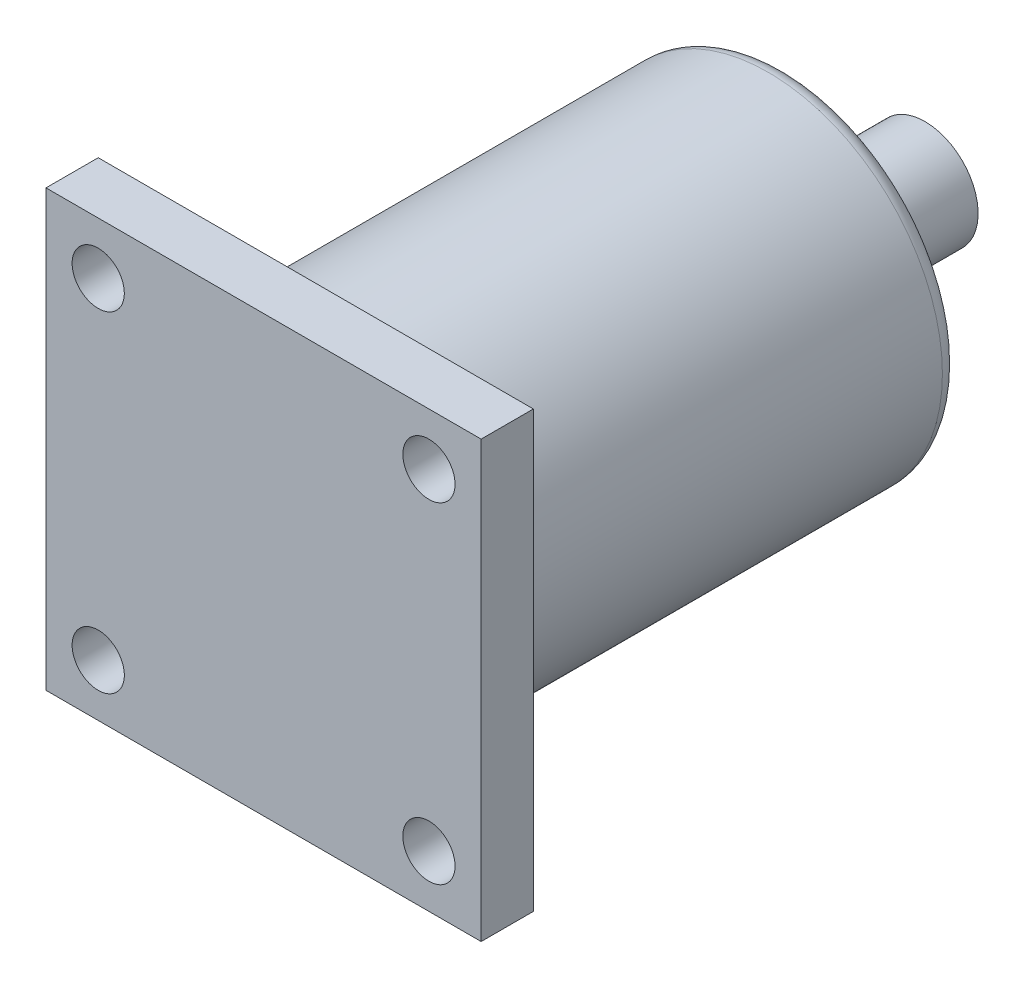
ISO-10303-21;
HEADER;
FILE_DESCRIPTION(('STEP AP214'),'2;1');
FILE_NAME('part.step','',(''),(''),'','','');
FILE_SCHEMA(('AUTOMOTIVE_DESIGN { 1 0 10303 214 1 1 1 1 }'));
ENDSEC;
DATA;
#1=APPLICATION_CONTEXT('core data for automotive mechanical design processes');
#2=APPLICATION_PROTOCOL_DEFINITION('international standard','automotive_design',2000,#1);
#3=PRODUCT_CONTEXT('',#1,'mechanical');
#4=PRODUCT('Part','Part','',(#3));
#5=PRODUCT_RELATED_PRODUCT_CATEGORY('part','',(#4));
#6=PRODUCT_DEFINITION_FORMATION('','',#4);
#7=PRODUCT_DEFINITION_CONTEXT('part definition',#1,'design');
#8=PRODUCT_DEFINITION('design','',#6,#7);
#9=PRODUCT_DEFINITION_SHAPE('','',#8);
#10=(LENGTH_UNIT() NAMED_UNIT(*) SI_UNIT(.MILLI.,.METRE.));
#11=(NAMED_UNIT(*) PLANE_ANGLE_UNIT() SI_UNIT($,.RADIAN.));
#12=(NAMED_UNIT(*) SI_UNIT($,.STERADIAN.) SOLID_ANGLE_UNIT());
#13=UNCERTAINTY_MEASURE_WITH_UNIT(LENGTH_MEASURE(1.E-05),#10,'distance_accuracy_value','');
#14=(GEOMETRIC_REPRESENTATION_CONTEXT(3) GLOBAL_UNCERTAINTY_ASSIGNED_CONTEXT((#13)) GLOBAL_UNIT_ASSIGNED_CONTEXT((#10,
#11,#12)) REPRESENTATION_CONTEXT('',''));
#15=CARTESIAN_POINT('',(0.,0.,0.));
#16=DIRECTION('',(0.,0.,1.));
#17=DIRECTION('',(1.,0.,0.));
#18=AXIS2_PLACEMENT_3D('',#15,#16,#17);
#19=CARTESIAN_POINT('',(0.,0.,3.));
#20=DIRECTION('',(1.,0.,0.));
#21=DIRECTION('',(0.,1.,0.));
#22=AXIS2_PLACEMENT_3D('',#19,#20,#21);
#23=PLANE('',#22);
#24=DIRECTION('',(0.,-1.,0.));
#25=VECTOR('',#24,1.);
#26=CARTESIAN_POINT('',(0.,0.,0.));
#27=LINE('',#26,#25);
#28=CARTESIAN_POINT('',(0.,0.,0.));
#29=VERTEX_POINT('',#28);
#30=CARTESIAN_POINT('',(0.,-25.,0.));
#31=VERTEX_POINT('',#30);
#32=EDGE_CURVE('E101',#29,#31,#27,.T.);
#33=ORIENTED_EDGE('',*,*,#32,.T.);
#34=DIRECTION('',(0.,0.,-1.));
#35=VECTOR('',#34,1.);
#36=CARTESIAN_POINT('',(0.,-25.,3.));
#37=LINE('',#36,#35);
#38=CARTESIAN_POINT('',(0.,-25.,3.));
#39=VERTEX_POINT('',#38);
#40=EDGE_CURVE('E92',#39,#31,#37,.T.);
#41=ORIENTED_EDGE('',*,*,#40,.F.);
#42=DIRECTION('',(0.,-1.,0.));
#43=VECTOR('',#42,1.);
#44=CARTESIAN_POINT('',(0.,0.,3.));
#45=LINE('',#44,#43);
#46=CARTESIAN_POINT('',(0.,0.,3.));
#47=VERTEX_POINT('',#46);
#48=EDGE_CURVE('E86',#47,#39,#45,.T.);
#49=ORIENTED_EDGE('',*,*,#48,.F.);
#50=DIRECTION('',(0.,0.,-1.));
#51=VECTOR('',#50,1.);
#52=CARTESIAN_POINT('',(0.,0.,3.));
#53=LINE('',#52,#51);
#54=EDGE_CURVE('E97',#47,#29,#53,.T.);
#55=ORIENTED_EDGE('',*,*,#54,.T.);
#56=EDGE_LOOP('',(#33,#41,#49,#55));
#57=FACE_BOUND('',#56,.T.);
#58=ADVANCED_FACE('F33',(#57),#23,.F.);
#59=CARTESIAN_POINT('',(0.,-25.,3.));
#60=DIRECTION('',(0.,1.,0.));
#61=DIRECTION('',(0.,0.,1.));
#62=AXIS2_PLACEMENT_3D('',#59,#60,#61);
#63=PLANE('',#62);
#64=DIRECTION('',(1.,0.,0.));
#65=VECTOR('',#64,1.);
#66=CARTESIAN_POINT('',(0.,-25.,0.));
#67=LINE('',#66,#65);
#68=CARTESIAN_POINT('',(25.,-25.,0.));
#69=VERTEX_POINT('',#68);
#70=EDGE_CURVE('E91',#31,#69,#67,.T.);
#71=ORIENTED_EDGE('',*,*,#70,.T.);
#72=DIRECTION('',(0.,0.,-1.));
#73=VECTOR('',#72,1.);
#74=CARTESIAN_POINT('',(25.,-25.,3.));
#75=LINE('',#74,#73);
#76=CARTESIAN_POINT('',(25.,-25.,3.));
#77=VERTEX_POINT('',#76);
#78=EDGE_CURVE('E89',#77,#69,#75,.T.);
#79=ORIENTED_EDGE('',*,*,#78,.F.);
#80=DIRECTION('',(1.,0.,0.));
#81=VECTOR('',#80,1.);
#82=CARTESIAN_POINT('',(0.,-25.,3.));
#83=LINE('',#82,#81);
#84=EDGE_CURVE('E81',#39,#77,#83,.T.);
#85=ORIENTED_EDGE('',*,*,#84,.F.);
#86=ORIENTED_EDGE('',*,*,#40,.T.);
#87=EDGE_LOOP('',(#71,#79,#85,#86));
#88=FACE_BOUND('',#87,.T.);
#89=ADVANCED_FACE('F90',(#88),#63,.F.);
#90=CARTESIAN_POINT('',(25.,0.,3.));
#91=DIRECTION('',(-1.,0.,0.));
#92=DIRECTION('',(0.,-1.,0.));
#93=AXIS2_PLACEMENT_3D('',#90,#91,#92);
#94=PLANE('',#93);
#95=DIRECTION('',(0.,1.,0.));
#96=VECTOR('',#95,1.);
#97=CARTESIAN_POINT('',(25.,0.,0.));
#98=LINE('',#97,#96);
#99=CARTESIAN_POINT('',(25.,0.,0.));
#100=VERTEX_POINT('',#99);
#101=EDGE_CURVE('E67',#69,#100,#98,.T.);
#102=ORIENTED_EDGE('',*,*,#101,.T.);
#103=DIRECTION('',(0.,0.,-1.));
#104=VECTOR('',#103,1.);
#105=CARTESIAN_POINT('',(25.,0.,3.));
#106=LINE('',#105,#104);
#107=CARTESIAN_POINT('',(25.,0.,3.));
#108=VERTEX_POINT('',#107);
#109=EDGE_CURVE('E93',#108,#100,#106,.T.);
#110=ORIENTED_EDGE('',*,*,#109,.F.);
#111=DIRECTION('',(0.,1.,0.));
#112=VECTOR('',#111,1.);
#113=CARTESIAN_POINT('',(25.,0.,3.));
#114=LINE('',#113,#112);
#115=EDGE_CURVE('E84',#77,#108,#114,.T.);
#116=ORIENTED_EDGE('',*,*,#115,.F.);
#117=ORIENTED_EDGE('',*,*,#78,.T.);
#118=EDGE_LOOP('',(#102,#110,#116,#117));
#119=FACE_BOUND('',#118,.T.);
#120=ADVANCED_FACE('F95',(#119),#94,.F.);
#121=CARTESIAN_POINT('',(0.,0.,3.));
#122=DIRECTION('',(0.,-1.,0.));
#123=DIRECTION('',(0.,0.,-1.));
#124=AXIS2_PLACEMENT_3D('',#121,#122,#123);
#125=PLANE('',#124);
#126=DIRECTION('',(-1.,0.,0.));
#127=VECTOR('',#126,1.);
#128=CARTESIAN_POINT('',(0.,0.,0.));
#129=LINE('',#128,#127);
#130=EDGE_CURVE('E73',#100,#29,#129,.T.);
#131=ORIENTED_EDGE('',*,*,#130,.T.);
#132=ORIENTED_EDGE('',*,*,#54,.F.);
#133=DIRECTION('',(-1.,0.,0.));
#134=VECTOR('',#133,1.);
#135=CARTESIAN_POINT('',(0.,0.,3.));
#136=LINE('',#135,#134);
#137=EDGE_CURVE('E50',#108,#47,#136,.T.);
#138=ORIENTED_EDGE('',*,*,#137,.F.);
#139=ORIENTED_EDGE('',*,*,#109,.T.);
#140=EDGE_LOOP('',(#131,#132,#138,#139));
#141=FACE_BOUND('',#140,.T.);
#142=ADVANCED_FACE('F163',(#141),#125,.F.);
#143=CARTESIAN_POINT('',(0.,0.,3.));
#144=DIRECTION('',(0.,0.,1.));
#145=DIRECTION('',(1.,0.,0.));
#146=AXIS2_PLACEMENT_3D('',#143,#144,#145);
#147=PLANE('',#146);
#148=CARTESIAN_POINT('',(22.,-22.,3.));
#149=DIRECTION('',(0.,0.,-1.));
#150=DIRECTION('',(1.,0.,0.));
#151=AXIS2_PLACEMENT_3D('',#148,#149,#150);
#152=CIRCLE('',#151,1.5);
#153=CARTESIAN_POINT('',(23.5,-22.,3.));
#154=VERTEX_POINT('',#153);
#155=EDGE_CURVE('E292',#154,#154,#152,.T.);
#156=ORIENTED_EDGE('',*,*,#155,.T.);
#157=EDGE_LOOP('',(#156));
#158=FACE_BOUND('',#157,.T.);
#159=CARTESIAN_POINT('',(3.,-22.,3.));
#160=DIRECTION('',(0.,0.,-1.));
#161=DIRECTION('',(-1.,0.,0.));
#162=AXIS2_PLACEMENT_3D('',#159,#160,#161);
#163=CIRCLE('',#162,1.5);
#164=CARTESIAN_POINT('',(1.49999999999999,-22.,3.));
#165=VERTEX_POINT('',#164);
#166=EDGE_CURVE('E301',#165,#165,#163,.T.);
#167=ORIENTED_EDGE('',*,*,#166,.T.);
#168=EDGE_LOOP('',(#167));
#169=FACE_BOUND('',#168,.T.);
#170=CARTESIAN_POINT('',(3.,-3.,3.));
#171=DIRECTION('',(0.,0.,-1.));
#172=DIRECTION('',(1.,0.,0.));
#173=AXIS2_PLACEMENT_3D('',#170,#171,#172);
#174=CIRCLE('',#173,1.5);
#175=CARTESIAN_POINT('',(4.5,-3.,3.));
#176=VERTEX_POINT('',#175);
#177=EDGE_CURVE('E297',#176,#176,#174,.T.);
#178=ORIENTED_EDGE('',*,*,#177,.T.);
#179=EDGE_LOOP('',(#178));
#180=FACE_BOUND('',#179,.T.);
#181=CARTESIAN_POINT('',(22.,-3.,3.));
#182=DIRECTION('',(0.,0.,-1.));
#183=DIRECTION('',(-1.,0.,0.));
#184=AXIS2_PLACEMENT_3D('',#181,#182,#183);
#185=CIRCLE('',#184,1.5);
#186=CARTESIAN_POINT('',(20.5,-3.,3.));
#187=VERTEX_POINT('',#186);
#188=EDGE_CURVE('E104',#187,#187,#185,.T.);
#189=ORIENTED_EDGE('',*,*,#188,.T.);
#190=EDGE_LOOP('',(#189));
#191=FACE_BOUND('',#190,.T.);
#192=ORIENTED_EDGE('',*,*,#48,.T.);
#193=ORIENTED_EDGE('',*,*,#84,.T.);
#194=ORIENTED_EDGE('',*,*,#115,.T.);
#195=ORIENTED_EDGE('',*,*,#137,.T.);
#196=EDGE_LOOP('',(#192,#193,#194,#195));
#197=FACE_BOUND('',#196,.T.);
#198=ADVANCED_FACE('F82',(#158,#169,#180,#191,#197),#147,.T.);
#199=CARTESIAN_POINT('',(0.,0.,0.));
#200=DIRECTION('',(0.,0.,1.));
#201=DIRECTION('',(1.,0.,0.));
#202=AXIS2_PLACEMENT_3D('',#199,#200,#201);
#203=PLANE('',#202);
#204=CARTESIAN_POINT('',(12.5,-12.5,0.));
#205=DIRECTION('',(0.,0.,1.));
#206=DIRECTION('',(1.,0.,0.));
#207=AXIS2_PLACEMENT_3D('',#204,#205,#206);
#208=CIRCLE('',#207,11.);
#209=CARTESIAN_POINT('',(23.5,-12.5,0.));
#210=VERTEX_POINT('',#209);
#211=EDGE_CURVE('E11',#210,#210,#208,.T.);
#212=ORIENTED_EDGE('',*,*,#211,.T.);
#213=EDGE_LOOP('',(#212));
#214=FACE_BOUND('',#213,.T.);
#215=CARTESIAN_POINT('',(22.,-22.,0.));
#216=DIRECTION('',(0.,0.,-1.));
#217=DIRECTION('',(1.,0.,0.));
#218=AXIS2_PLACEMENT_3D('',#215,#216,#217);
#219=CIRCLE('',#218,1.5);
#220=CARTESIAN_POINT('',(23.5,-22.,0.));
#221=VERTEX_POINT('',#220);
#222=EDGE_CURVE('E148',#221,#221,#219,.T.);
#223=ORIENTED_EDGE('',*,*,#222,.F.);
#224=EDGE_LOOP('',(#223));
#225=FACE_BOUND('',#224,.T.);
#226=CARTESIAN_POINT('',(3.,-22.,0.));
#227=DIRECTION('',(0.,0.,-1.));
#228=DIRECTION('',(-1.,0.,0.));
#229=AXIS2_PLACEMENT_3D('',#226,#227,#228);
#230=CIRCLE('',#229,1.5);
#231=CARTESIAN_POINT('',(1.49999999999999,-22.,0.));
#232=VERTEX_POINT('',#231);
#233=EDGE_CURVE('E152',#232,#232,#230,.T.);
#234=ORIENTED_EDGE('',*,*,#233,.F.);
#235=EDGE_LOOP('',(#234));
#236=FACE_BOUND('',#235,.T.);
#237=CARTESIAN_POINT('',(3.,-3.,0.));
#238=DIRECTION('',(0.,0.,-1.));
#239=DIRECTION('',(1.,0.,0.));
#240=AXIS2_PLACEMENT_3D('',#237,#238,#239);
#241=CIRCLE('',#240,1.5);
#242=CARTESIAN_POINT('',(4.5,-3.,0.));
#243=VERTEX_POINT('',#242);
#244=EDGE_CURVE('E156',#243,#243,#241,.T.);
#245=ORIENTED_EDGE('',*,*,#244,.F.);
#246=EDGE_LOOP('',(#245));
#247=FACE_BOUND('',#246,.T.);
#248=CARTESIAN_POINT('',(22.,-3.,0.));
#249=DIRECTION('',(0.,0.,-1.));
#250=DIRECTION('',(-1.,0.,0.));
#251=AXIS2_PLACEMENT_3D('',#248,#249,#250);
#252=CIRCLE('',#251,1.5);
#253=CARTESIAN_POINT('',(20.5,-3.,0.));
#254=VERTEX_POINT('',#253);
#255=EDGE_CURVE('E160',#254,#254,#252,.T.);
#256=ORIENTED_EDGE('',*,*,#255,.F.);
#257=EDGE_LOOP('',(#256));
#258=FACE_BOUND('',#257,.T.);
#259=ORIENTED_EDGE('',*,*,#32,.F.);
#260=ORIENTED_EDGE('',*,*,#130,.F.);
#261=ORIENTED_EDGE('',*,*,#101,.F.);
#262=ORIENTED_EDGE('',*,*,#70,.F.);
#263=EDGE_LOOP('',(#259,#260,#261,#262));
#264=FACE_BOUND('',#263,.T.);
#265=ADVANCED_FACE('F140',(#214,#225,#236,#247,#258,#264),#203,.F.);
#266=CARTESIAN_POINT('',(22.,-3.,3.));
#267=DIRECTION('',(0.,0.,-1.));
#268=DIRECTION('',(-1.,0.,0.));
#269=AXIS2_PLACEMENT_3D('',#266,#267,#268);
#270=CYLINDRICAL_SURFACE('',#269,1.5);
#271=ORIENTED_EDGE('',*,*,#188,.F.);
#272=EDGE_LOOP('',(#271));
#273=FACE_BOUND('',#272,.T.);
#274=ORIENTED_EDGE('',*,*,#255,.T.);
#275=EDGE_LOOP('',(#274));
#276=FACE_BOUND('',#275,.T.);
#277=ADVANCED_FACE('F143',(#273,#276),#270,.F.);
#278=CARTESIAN_POINT('',(3.,-3.,3.));
#279=DIRECTION('',(0.,0.,-1.));
#280=DIRECTION('',(-1.,0.,0.));
#281=AXIS2_PLACEMENT_3D('',#278,#279,#280);
#282=CYLINDRICAL_SURFACE('',#281,1.5);
#283=ORIENTED_EDGE('',*,*,#177,.F.);
#284=EDGE_LOOP('',(#283));
#285=FACE_BOUND('',#284,.T.);
#286=ORIENTED_EDGE('',*,*,#244,.T.);
#287=EDGE_LOOP('',(#286));
#288=FACE_BOUND('',#287,.T.);
#289=ADVANCED_FACE('F205',(#285,#288),#282,.F.);
#290=CARTESIAN_POINT('',(3.,-22.,3.));
#291=DIRECTION('',(0.,0.,-1.));
#292=DIRECTION('',(-1.,0.,0.));
#293=AXIS2_PLACEMENT_3D('',#290,#291,#292);
#294=CYLINDRICAL_SURFACE('',#293,1.5);
#295=ORIENTED_EDGE('',*,*,#166,.F.);
#296=EDGE_LOOP('',(#295));
#297=FACE_BOUND('',#296,.T.);
#298=ORIENTED_EDGE('',*,*,#233,.T.);
#299=EDGE_LOOP('',(#298));
#300=FACE_BOUND('',#299,.T.);
#301=ADVANCED_FACE('F215',(#297,#300),#294,.F.);
#302=CARTESIAN_POINT('',(22.,-22.,3.));
#303=DIRECTION('',(0.,0.,-1.));
#304=DIRECTION('',(-1.,0.,0.));
#305=AXIS2_PLACEMENT_3D('',#302,#303,#304);
#306=CYLINDRICAL_SURFACE('',#305,1.5);
#307=ORIENTED_EDGE('',*,*,#155,.F.);
#308=EDGE_LOOP('',(#307));
#309=FACE_BOUND('',#308,.T.);
#310=ORIENTED_EDGE('',*,*,#222,.T.);
#311=EDGE_LOOP('',(#310));
#312=FACE_BOUND('',#311,.T.);
#313=ADVANCED_FACE('F132',(#309,#312),#306,.F.);
#314=CARTESIAN_POINT('',(12.5,-12.5,-27.));
#315=DIRECTION('',(0.,0.,1.));
#316=DIRECTION('',(1.,0.,0.));
#317=AXIS2_PLACEMENT_3D('',#314,#315,#316);
#318=CYLINDRICAL_SURFACE('',#317,10.);
#319=CARTESIAN_POINT('',(12.5,-12.5,-26.));
#320=DIRECTION('',(0.,0.,1.));
#321=DIRECTION('',(1.,0.,0.));
#322=AXIS2_PLACEMENT_3D('',#319,#320,#321);
#323=CIRCLE('',#322,10.);
#324=CARTESIAN_POINT('',(22.5,-12.5,-26.));
#325=VERTEX_POINT('',#324);
#326=EDGE_CURVE('E115',#325,#325,#323,.T.);
#327=ORIENTED_EDGE('',*,*,#326,.T.);
#328=EDGE_LOOP('',(#327));
#329=FACE_BOUND('',#328,.T.);
#330=CARTESIAN_POINT('',(12.5,-12.5,-1.));
#331=DIRECTION('',(0.,0.,1.));
#332=DIRECTION('',(1.,0.,0.));
#333=AXIS2_PLACEMENT_3D('',#330,#331,#332);
#334=CIRCLE('',#333,10.);
#335=CARTESIAN_POINT('',(22.5,-12.5,-1.));
#336=VERTEX_POINT('',#335);
#337=EDGE_CURVE('E112',#336,#336,#334,.F.);
#338=ORIENTED_EDGE('',*,*,#337,.T.);
#339=EDGE_LOOP('',(#338));
#340=FACE_BOUND('',#339,.T.);
#341=ADVANCED_FACE('F129',(#329,#340),#318,.T.);
#342=CARTESIAN_POINT('',(12.5,-12.5,-27.));
#343=DIRECTION('',(0.,0.,1.));
#344=DIRECTION('',(1.,0.,0.));
#345=AXIS2_PLACEMENT_3D('',#342,#343,#344);
#346=PLANE('',#345);
#347=CARTESIAN_POINT('',(12.5,-12.5,-27.));
#348=DIRECTION('',(0.,0.,1.));
#349=DIRECTION('',(1.,0.,0.));
#350=AXIS2_PLACEMENT_3D('',#347,#348,#349);
#351=CIRCLE('',#350,9.);
#352=CARTESIAN_POINT('',(21.5,-12.5,-27.));
#353=VERTEX_POINT('',#352);
#354=EDGE_CURVE('E42',#353,#353,#351,.F.);
#355=ORIENTED_EDGE('',*,*,#354,.T.);
#356=EDGE_LOOP('',(#355));
#357=FACE_BOUND('',#356,.T.);
#358=CARTESIAN_POINT('',(12.5,-12.5,-27.));
#359=DIRECTION('',(0.,0.,-1.));
#360=DIRECTION('',(-1.,0.,0.));
#361=AXIS2_PLACEMENT_3D('',#358,#359,#360);
#362=CIRCLE('',#361,3.05);
#363=CARTESIAN_POINT('',(9.45,-12.5,-27.));
#364=VERTEX_POINT('',#363);
#365=EDGE_CURVE('E111',#364,#364,#362,.T.);
#366=ORIENTED_EDGE('',*,*,#365,.F.);
#367=EDGE_LOOP('',(#366));
#368=FACE_BOUND('',#367,.T.);
#369=ADVANCED_FACE('F120',(#357,#368),#346,.F.);
#370=CARTESIAN_POINT('',(12.5,-12.5,-35.));
#371=DIRECTION('',(0.,0.,1.));
#372=DIRECTION('',(1.,0.,0.));
#373=AXIS2_PLACEMENT_3D('',#370,#371,#372);
#374=CYLINDRICAL_SURFACE('',#373,3.05);
#375=CARTESIAN_POINT('',(12.5,-12.5,-35.));
#376=DIRECTION('',(0.,0.,-1.));
#377=DIRECTION('',(-1.,0.,0.));
#378=AXIS2_PLACEMENT_3D('',#375,#376,#377);
#379=CIRCLE('',#378,3.05);
#380=CARTESIAN_POINT('',(9.45,-12.5,-35.));
#381=VERTEX_POINT('',#380);
#382=EDGE_CURVE('E290',#381,#381,#379,.T.);
#383=ORIENTED_EDGE('',*,*,#382,.F.);
#384=EDGE_LOOP('',(#383));
#385=FACE_BOUND('',#384,.T.);
#386=ORIENTED_EDGE('',*,*,#365,.T.);
#387=EDGE_LOOP('',(#386));
#388=FACE_BOUND('',#387,.T.);
#389=ADVANCED_FACE('F240',(#385,#388),#374,.T.);
#390=CARTESIAN_POINT('',(12.5,-12.5,-35.));
#391=DIRECTION('',(0.,0.,-1.));
#392=DIRECTION('',(-1.,0.,0.));
#393=AXIS2_PLACEMENT_3D('',#390,#391,#392);
#394=PLANE('',#393);
#395=ORIENTED_EDGE('',*,*,#382,.T.);
#396=EDGE_LOOP('',(#395));
#397=FACE_BOUND('',#396,.T.);
#398=ADVANCED_FACE('F126',(#397),#394,.T.);
#399=CARTESIAN_POINT('',(12.5,-12.5,-26.));
#400=DIRECTION('',(0.,0.,1.));
#401=DIRECTION('',(1.,0.,0.));
#402=AXIS2_PLACEMENT_3D('',#399,#400,#401);
#403=TOROIDAL_SURFACE('',#402,9.,1.);
#404=ORIENTED_EDGE('',*,*,#354,.F.);
#405=EDGE_LOOP('',(#404));
#406=FACE_BOUND('',#405,.T.);
#407=ORIENTED_EDGE('',*,*,#326,.F.);
#408=EDGE_LOOP('',(#407));
#409=FACE_BOUND('',#408,.T.);
#410=ADVANCED_FACE('F123',(#406,#409),#403,.T.);
#411=CARTESIAN_POINT('',(12.5,-12.5,-1.));
#412=DIRECTION('',(0.,0.,1.));
#413=DIRECTION('',(1.,0.,0.));
#414=AXIS2_PLACEMENT_3D('',#411,#412,#413);
#415=TOROIDAL_SURFACE('',#414,11.,1.);
#416=ORIENTED_EDGE('',*,*,#337,.F.);
#417=EDGE_LOOP('',(#416));
#418=FACE_BOUND('',#417,.T.);
#419=ORIENTED_EDGE('',*,*,#211,.F.);
#420=EDGE_LOOP('',(#419));
#421=FACE_BOUND('',#420,.T.);
#422=ADVANCED_FACE('F35',(#418,#421),#415,.F.);
#423=CLOSED_SHELL('',(#58,#89,#120,#142,#198,#265,#277,#289,#301,#313,#341,#369,#389,#398,#410,#422));
#424=MANIFOLD_SOLID_BREP('B2',#423);
#425=ADVANCED_BREP_SHAPE_REPRESENTATION('',(#18,#424),#14);
#426=SHAPE_DEFINITION_REPRESENTATION(#9,#425);
ENDSEC;
END-ISO-10303-21;
